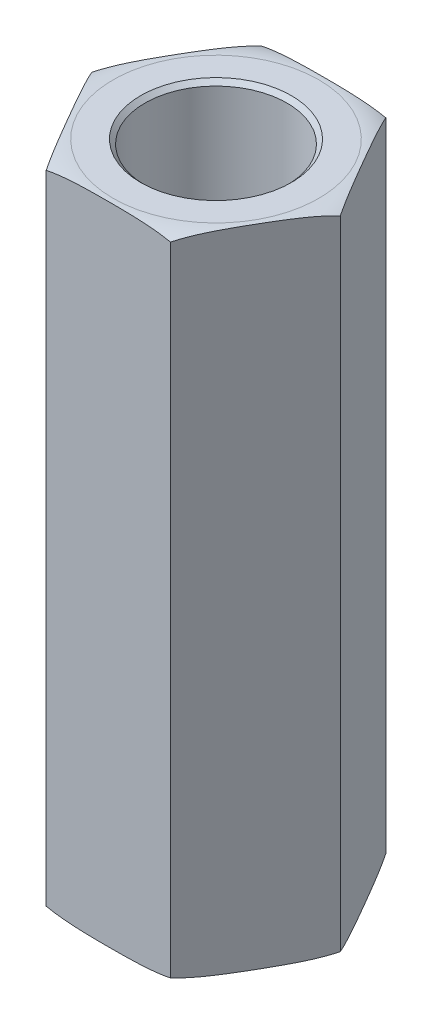
ISO-10303-21;
HEADER;
FILE_DESCRIPTION(('STEP AP214'),'2;1');
FILE_NAME('part.step','',(''),(''),'','','');
FILE_SCHEMA(('AUTOMOTIVE_DESIGN { 1 0 10303 214 1 1 1 1 }'));
ENDSEC;
DATA;
#1=APPLICATION_CONTEXT('core data for automotive mechanical design processes');
#2=APPLICATION_PROTOCOL_DEFINITION('international standard','automotive_design',2000,#1);
#3=PRODUCT_CONTEXT('',#1,'mechanical');
#4=PRODUCT('Part','Part','',(#3));
#5=PRODUCT_RELATED_PRODUCT_CATEGORY('part','',(#4));
#6=PRODUCT_DEFINITION_FORMATION('','',#4);
#7=PRODUCT_DEFINITION_CONTEXT('part definition',#1,'design');
#8=PRODUCT_DEFINITION('design','',#6,#7);
#9=PRODUCT_DEFINITION_SHAPE('','',#8);
#10=(LENGTH_UNIT() NAMED_UNIT(*) SI_UNIT(.MILLI.,.METRE.));
#11=(NAMED_UNIT(*) PLANE_ANGLE_UNIT() SI_UNIT($,.RADIAN.));
#12=(NAMED_UNIT(*) SI_UNIT($,.STERADIAN.) SOLID_ANGLE_UNIT());
#13=UNCERTAINTY_MEASURE_WITH_UNIT(LENGTH_MEASURE(1.E-05),#10,'distance_accuracy_value','');
#14=(GEOMETRIC_REPRESENTATION_CONTEXT(3) GLOBAL_UNCERTAINTY_ASSIGNED_CONTEXT((#13)) GLOBAL_UNIT_ASSIGNED_CONTEXT((#10,
#11,#12)) REPRESENTATION_CONTEXT('',''));
#15=CARTESIAN_POINT('',(0.,0.,0.));
#16=DIRECTION('',(0.,0.,1.));
#17=DIRECTION('',(1.,0.,0.));
#18=AXIS2_PLACEMENT_3D('',#15,#16,#17);
#19=CARTESIAN_POINT('',(3.66617420935412,9.525,0.));
#20=DIRECTION('',(-0.866025403784439,0.,0.5));
#21=DIRECTION('',(0.5,0.,0.866025403784439));
#22=AXIS2_PLACEMENT_3D('',#19,#20,#21);
#23=PLANE('',#22);
#24=DIRECTION('',(0.,1.,0.));
#25=VECTOR('',#24,1.);
#26=CARTESIAN_POINT('',(1.83308710467705,9.525,-3.175));
#27=LINE('',#26,#25);
#28=CARTESIAN_POINT('',(1.83308710467705,-9.398,-3.175));
#29=VERTEX_POINT('',#28);
#30=CARTESIAN_POINT('',(1.83308710467706,9.398,-3.175));
#31=VERTEX_POINT('',#30);
#32=EDGE_CURVE('E143',#29,#31,#27,.T.);
#33=ORIENTED_EDGE('',*,*,#32,.T.);
#34=CARTESIAN_POINT('',(3.66617420935412,9.398,0.));
#35=CARTESIAN_POINT('',(3.62797961467395,9.41390141489969,-0.0661549785605542));
#36=CARTESIAN_POINT('',(3.58956810864157,9.4274886076105,-0.132685658603869));
#37=CARTESIAN_POINT('',(3.51249051795711,9.45081619794021,-0.266187961794349));
#38=CARTESIAN_POINT('',(3.47382473049847,9.46056047713974,-0.333159070187379));
#39=CARTESIAN_POINT('',(3.39641631867874,9.4769966530451,-0.467234372392366));
#40=CARTESIAN_POINT('',(3.35767399633313,9.48369453286691,-0.534338043098168));
#41=CARTESIAN_POINT('',(3.28009834620114,9.4947767572932,-0.668703010556962));
#42=CARTESIAN_POINT('',(3.24126499587772,9.49916045047396,-0.735964346345247));
#43=CARTESIAN_POINT('',(3.16354065964316,9.50624030042628,-0.870586845688074));
#44=CARTESIAN_POINT('',(3.12464965374477,9.50893552375912,-0.937948043861543));
#45=CARTESIAN_POINT('',(3.04685144594594,9.51315319837134,-1.07269849250692));
#46=CARTESIAN_POINT('',(3.00794424351971,9.51467560802717,-1.14008774388952));
#47=CARTESIAN_POINT('',(2.93051517598875,9.51692270588903,-1.27419882283583));
#48=CARTESIAN_POINT('',(2.89199336248936,9.51765524681809,-1.34092056101645));
#49=CARTESIAN_POINT('',(2.81494778346146,9.51857673025742,-1.47436741839135));
#50=CARTESIAN_POINT('',(2.77642401791441,9.51876566589491,-1.5410925376177));
#51=CARTESIAN_POINT('',(2.69935964431015,9.51866599668056,-1.67457194815376));
#52=CARTESIAN_POINT('',(2.66081903631824,9.51837718117656,-1.74132623935034));
#53=CARTESIAN_POINT('',(2.58373908085332,9.517221986219,-1.87483263846072));
#54=CARTESIAN_POINT('',(2.54519973341248,9.51635559703857,-1.94158474631881));
#55=CARTESIAN_POINT('',(2.46812969629774,9.51378619406564,-2.07507396634277));
#56=CARTESIAN_POINT('',(2.42959900625968,9.51208322716166,-2.14181107913937));
#57=CARTESIAN_POINT('',(2.35255651340912,9.50743872297261,-2.27525259109831));
#58=CARTESIAN_POINT('',(2.31404470975446,9.50449724713581,-2.34195699171929));
#59=CARTESIAN_POINT('',(2.25084206239948,9.49821741247489,-2.45142718811098));
#60=CARTESIAN_POINT('',(2.22613849337013,9.49539801104633,-2.4942150247981));
#61=CARTESIAN_POINT('',(2.1767694527223,9.48886967943037,-2.57972471152106));
#62=CARTESIAN_POINT('',(2.15210397034186,9.48516108091391,-2.62244658019719));
#63=CARTESIAN_POINT('',(2.10282753811698,9.4766802711497,-2.70779586442641));
#64=CARTESIAN_POINT('',(2.07821657107531,9.47190846570085,-2.75042330976598));
#65=CARTESIAN_POINT('',(2.02900094683551,9.4610987712516,-2.83566727147553));
#66=CARTESIAN_POINT('',(2.00439646085464,9.45505773130843,-2.87828349128851));
#67=CARTESIAN_POINT('',(1.95527325900934,9.44151383541612,-2.96336737271503));
#68=CARTESIAN_POINT('',(1.93075459617615,9.43401019780297,-3.00583494247578));
#69=CARTESIAN_POINT('',(1.88182157373171,9.41732035070844,-3.09058942351744));
#70=CARTESIAN_POINT('',(1.85740744053269,9.40813149780328,-3.1328759426409));
#71=CARTESIAN_POINT('',(1.83308710467706,9.398,-3.175));
#72=B_SPLINE_CURVE_WITH_KNOTS('',3,(#34,#35,#36,#37,#38,#39,#40,#41,#42,#43,#44,#45,#46,#47,#48,
#49,#50,#51,#52,#53,#54,#55,#56,#57,#58,#59,#60,#61,#62,#63,#64,#65,#66,#67,#68,#69,#70,#71),
.UNSPECIFIED.,.F.,.F.,(4,2,2,2,2,2,2,2,2,2,2,2,2,2,2,2,2,2,4),(0.,0.233977307817935,
0.467717675040681,0.70099697355748,0.934341903229723,1.16781571967236,1.40129782179821,
1.63243665809665,1.86357841666612,2.09482211846288,2.32606971471488,2.5573043514739,
2.78852751694405,2.93698369265081,3.08538458004469,3.23372892334581,3.3824459854661,
3.53124274626083,3.68027493713586),.UNSPECIFIED.);
#73=CARTESIAN_POINT('',(3.66617420935412,9.398,0.));
#74=VERTEX_POINT('',#73);
#75=EDGE_CURVE('E97',#74,#31,#72,.T.);
#76=ORIENTED_EDGE('',*,*,#75,.F.);
#77=DIRECTION('',(0.,1.,0.));
#78=VECTOR('',#77,1.);
#79=CARTESIAN_POINT('',(3.66617420935412,9.525,0.));
#80=LINE('',#79,#78);
#81=CARTESIAN_POINT('',(3.66617420935412,-9.398,0.));
#82=VERTEX_POINT('',#81);
#83=EDGE_CURVE('E145',#74,#82,#80,.F.);
#84=ORIENTED_EDGE('',*,*,#83,.T.);
#85=CARTESIAN_POINT('',(1.83308710467705,-9.398,-3.17500000000001));
#86=CARTESIAN_POINT('',(1.87128169935722,-9.41390141489968,-3.10884502143945));
#87=CARTESIAN_POINT('',(1.9096932053896,-9.4274886076105,-3.04231434139614));
#88=CARTESIAN_POINT('',(1.98677079607406,-9.4508161979402,-2.90881203820566));
#89=CARTESIAN_POINT('',(2.0254365835327,-9.46056047713973,-2.84184092981263));
#90=CARTESIAN_POINT('',(2.10284499535243,-9.47699665304509,-2.70776562760765));
#91=CARTESIAN_POINT('',(2.14158731769803,-9.48369453286691,-2.64066195690184));
#92=CARTESIAN_POINT('',(2.21916296783002,-9.49477675729319,-2.50629698944305));
#93=CARTESIAN_POINT('',(2.25799631815344,-9.49916045047396,-2.43903565365477));
#94=CARTESIAN_POINT('',(2.335720654388,-9.50624030042628,-2.30441315431194));
#95=CARTESIAN_POINT('',(2.37461166028639,-9.50893552375912,-2.23705195613848));
#96=CARTESIAN_POINT('',(2.45240986808522,-9.51315319837134,-2.10230150749311));
#97=CARTESIAN_POINT('',(2.49131707051145,-9.51467560802717,-2.0349122561105));
#98=CARTESIAN_POINT('',(2.56874613804241,-9.51692270588903,-1.9008011771642));
#99=CARTESIAN_POINT('',(2.6072679515418,-9.51765524681809,-1.83407943898357));
#100=CARTESIAN_POINT('',(2.6843135305697,-9.51857673025742,-1.70063258160867));
#101=CARTESIAN_POINT('',(2.72283729611674,-9.51876566589491,-1.63390746238233));
#102=CARTESIAN_POINT('',(2.79990166972101,-9.51866599668056,-1.50042805184627));
#103=CARTESIAN_POINT('',(2.83844227771292,-9.51837718117656,-1.43367376064969));
#104=CARTESIAN_POINT('',(2.91552223317783,-9.517221986219,-1.30016736153931));
#105=CARTESIAN_POINT('',(2.95406158061867,-9.51635559703857,-1.23341525368122));
#106=CARTESIAN_POINT('',(3.03113161773342,-9.51378619406564,-1.09992603365727));
#107=CARTESIAN_POINT('',(3.06966230777147,-9.51208322716166,-1.03318892086067));
#108=CARTESIAN_POINT('',(3.14670480062203,-9.50743872297261,-0.899747408901733));
#109=CARTESIAN_POINT('',(3.18521660427669,-9.50449724713582,-0.83304300828075));
#110=CARTESIAN_POINT('',(3.24841925163167,-9.49821741247489,-0.723572811889063));
#111=CARTESIAN_POINT('',(3.27312282066102,-9.49539801104633,-0.680784975201942));
#112=CARTESIAN_POINT('',(3.32249186130885,-9.48886967943037,-0.595275288478971));
#113=CARTESIAN_POINT('',(3.3471573436893,-9.48516108091391,-0.552553419802841));
#114=CARTESIAN_POINT('',(3.39643377591418,-9.4766802711497,-0.46720413557362));
#115=CARTESIAN_POINT('',(3.42104474295585,-9.47190846570085,-0.424576690234039));
#116=CARTESIAN_POINT('',(3.47026036719565,-9.4610987712516,-0.339332728524487));
#117=CARTESIAN_POINT('',(3.49486485317652,-9.45505773130843,-0.296716508711511));
#118=CARTESIAN_POINT('',(3.54398805502183,-9.44151383541613,-0.211632627284978));
#119=CARTESIAN_POINT('',(3.56850671785502,-9.43401019780297,-0.169165057524231));
#120=CARTESIAN_POINT('',(3.61743974029946,-9.41732035070845,-0.08441057648256));
#121=CARTESIAN_POINT('',(3.64185387349848,-9.40813149780329,-0.0421240573591054));
#122=CARTESIAN_POINT('',(3.66617420935412,-9.398,0.));
#123=B_SPLINE_CURVE_WITH_KNOTS('',3,(#85,#86,#87,#88,#89,#90,#91,#92,#93,#94,#95,#96,#97,#98,
#99,#100,#101,#102,#103,#104,#105,#106,#107,#108,#109,#110,#111,#112,#113,#114,#115,#116,#117,
#118,#119,#120,#121,#122),.UNSPECIFIED.,.F.,.F.,(4,2,2,2,2,2,2,2,2,2,2,2,2,2,2,2,2,2,4),(0.,
0.233977307817932,0.467717675040674,0.700996973557469,0.934341903229708,1.16781571967234,
1.40129782179818,1.63243665809662,1.86357841666608,2.09482211846285,2.32606971471484,
2.55730435147386,2.78852751694401,2.93698369265077,3.08538458004466,3.23372892334579,
3.38244598546609,3.53124274626083,3.68027493713586),.UNSPECIFIED.);
#124=EDGE_CURVE('E221',#29,#82,#123,.T.);
#125=ORIENTED_EDGE('',*,*,#124,.F.);
#126=EDGE_LOOP('',(#33,#76,#84,#125));
#127=FACE_BOUND('',#126,.T.);
#128=ADVANCED_FACE('F17',(#127),#23,.F.);
#129=CARTESIAN_POINT('',(1.83308710467706,9.525,3.17499999999999));
#130=DIRECTION('',(-0.866025403784439,0.,-0.5));
#131=DIRECTION('',(-0.5,0.,0.866025403784439));
#132=AXIS2_PLACEMENT_3D('',#129,#130,#131);
#133=PLANE('',#132);
#134=ORIENTED_EDGE('',*,*,#83,.F.);
#135=CARTESIAN_POINT('',(1.83308710467706,9.398,3.17499999999999));
#136=CARTESIAN_POINT('',(1.87128169935724,9.41390141489969,3.10884502143943));
#137=CARTESIAN_POINT('',(1.90969320538961,9.4274886076105,3.04231434139612));
#138=CARTESIAN_POINT('',(1.98677079607407,9.45081619794021,2.90881203820564));
#139=CARTESIAN_POINT('',(2.02543658353271,9.46056047713974,2.84184092981261));
#140=CARTESIAN_POINT('',(2.10284499535245,9.4769966530451,2.70776562760762));
#141=CARTESIAN_POINT('',(2.14158731769805,9.48369453286691,2.64066195690182));
#142=CARTESIAN_POINT('',(2.21916296783004,9.4947767572932,2.50629698944302));
#143=CARTESIAN_POINT('',(2.25799631815346,9.49916045047396,2.43903565365474));
#144=CARTESIAN_POINT('',(2.33572065438802,9.50624030042628,2.30441315431191));
#145=CARTESIAN_POINT('',(2.37461166028641,9.50893552375912,2.23705195613844));
#146=CARTESIAN_POINT('',(2.45240986808524,9.51315319837134,2.10230150749307));
#147=CARTESIAN_POINT('',(2.49131707051148,9.51467560802717,2.03491225611046));
#148=CARTESIAN_POINT('',(2.56874613804244,9.51692270588903,1.90080117716416));
#149=CARTESIAN_POINT('',(2.60726795154182,9.51765524681809,1.83407943898353));
#150=CARTESIAN_POINT('',(2.68431353056973,9.51857673025742,1.70063258160863));
#151=CARTESIAN_POINT('',(2.72283729611677,9.51876566589491,1.63390746238228));
#152=CARTESIAN_POINT('',(2.79990166972104,9.51866599668056,1.50042805184622));
#153=CARTESIAN_POINT('',(2.83844227771295,9.51837718117656,1.43367376064964));
#154=CARTESIAN_POINT('',(2.91552223317786,9.517221986219,1.30016736153926));
#155=CARTESIAN_POINT('',(2.95406158061871,9.51635559703857,1.23341525368117));
#156=CARTESIAN_POINT('',(3.03113161773345,9.51378619406564,1.09992603365721));
#157=CARTESIAN_POINT('',(3.06966230777151,9.51208322716166,1.03318892086061));
#158=CARTESIAN_POINT('',(3.14670480062207,9.50743872297261,0.899747408901672));
#159=CARTESIAN_POINT('',(3.18521660427673,9.50449724713581,0.833043008280688));
#160=CARTESIAN_POINT('',(3.24841925163171,9.49821741247489,0.723572811889004));
#161=CARTESIAN_POINT('',(3.27312282066106,9.49539801104633,0.680784975201887));
#162=CARTESIAN_POINT('',(3.32249186130888,9.48886967943037,0.595275288478923));
#163=CARTESIAN_POINT('',(3.34715734368933,9.48516108091391,0.552553419802797));
#164=CARTESIAN_POINT('',(3.3964337759142,9.4766802711497,0.467204135573584));
#165=CARTESIAN_POINT('',(3.42104474295588,9.47190846570085,0.424576690234007));
#166=CARTESIAN_POINT('',(3.47026036719567,9.4610987712516,0.339332728524462));
#167=CARTESIAN_POINT('',(3.49486485317654,9.45505773130843,0.296716508711489));
#168=CARTESIAN_POINT('',(3.54398805502184,9.44151383541612,0.211632627284964));
#169=CARTESIAN_POINT('',(3.56850671785503,9.43401019780297,0.169165057524221));
#170=CARTESIAN_POINT('',(3.61743974029946,9.41732035070844,0.0844105764825579));
#171=CARTESIAN_POINT('',(3.64185387349848,9.40813149780328,0.042124057359107));
#172=CARTESIAN_POINT('',(3.66617420935412,9.398,0.));
#173=B_SPLINE_CURVE_WITH_KNOTS('',3,(#135,#136,#137,#138,#139,#140,#141,#142,#143,#144,#145,
#146,#147,#148,#149,#150,#151,#152,#153,#154,#155,#156,#157,#158,#159,#160,#161,#162,#163,#164,
#165,#166,#167,#168,#169,#170,#171,#172),.UNSPECIFIED.,.F.,.F.,(4,2,2,2,2,2,2,2,2,2,2,2,2,2,2,2,
2,2,4),(0.,0.233977307817936,0.467717675040682,0.700996973557482,0.934341903229727,
1.16781571967237,1.40129782179821,1.63243665809666,1.86357841666612,2.09482211846289,
2.32606971471489,2.55730435147391,2.78852751694406,2.93698369265081,3.08538458004469,
3.23372892334581,3.3824459854661,3.53124274626082,3.68027493713584),.UNSPECIFIED.);
#174=CARTESIAN_POINT('',(1.83308710467707,9.398,3.17499999999999));
#175=VERTEX_POINT('',#174);
#176=EDGE_CURVE('E214',#175,#74,#173,.T.);
#177=ORIENTED_EDGE('',*,*,#176,.F.);
#178=DIRECTION('',(0.,1.,0.));
#179=VECTOR('',#178,1.);
#180=CARTESIAN_POINT('',(1.83308710467707,9.525,3.17499999999999));
#181=LINE('',#180,#179);
#182=CARTESIAN_POINT('',(1.83308710467706,-9.398,3.17499999999999));
#183=VERTEX_POINT('',#182);
#184=EDGE_CURVE('E140',#175,#183,#181,.F.);
#185=ORIENTED_EDGE('',*,*,#184,.T.);
#186=CARTESIAN_POINT('',(3.66617420935412,-9.398,0.));
#187=CARTESIAN_POINT('',(3.62797961467395,-9.41390141489969,0.0661549785605599));
#188=CARTESIAN_POINT('',(3.58956810864157,-9.4274886076105,0.132685658603875));
#189=CARTESIAN_POINT('',(3.51249051795711,-9.45081619794021,0.266187961794355));
#190=CARTESIAN_POINT('',(3.47382473049847,-9.46056047713974,0.333159070187385));
#191=CARTESIAN_POINT('',(3.39641631867874,-9.4769966530451,0.467234372392373));
#192=CARTESIAN_POINT('',(3.35767399633313,-9.48369453286691,0.534338043098174));
#193=CARTESIAN_POINT('',(3.28009834620114,-9.4947767572932,0.668703010556968));
#194=CARTESIAN_POINT('',(3.24126499587772,-9.49916045047396,0.735964346345254));
#195=CARTESIAN_POINT('',(3.16354065964316,-9.50624030042628,0.87058684568808));
#196=CARTESIAN_POINT('',(3.12464965374477,-9.50893552375912,0.93794804386155));
#197=CARTESIAN_POINT('',(3.04685144594594,-9.51315319837134,1.07269849250692));
#198=CARTESIAN_POINT('',(3.00794424351971,-9.51467560802717,1.14008774388953));
#199=CARTESIAN_POINT('',(2.93051517598875,-9.51692270588903,1.27419882283583));
#200=CARTESIAN_POINT('',(2.89199336248936,-9.51765524681809,1.34092056101646));
#201=CARTESIAN_POINT('',(2.81494778346145,-9.51857673025742,1.47436741839136));
#202=CARTESIAN_POINT('',(2.77642401791441,-9.51876566589491,1.54109253761771));
#203=CARTESIAN_POINT('',(2.69935964431015,-9.51866599668056,1.67457194815377));
#204=CARTESIAN_POINT('',(2.66081903631824,-9.51837718117656,1.74132623935035));
#205=CARTESIAN_POINT('',(2.58373908085332,-9.517221986219,1.87483263846073));
#206=CARTESIAN_POINT('',(2.54519973341248,-9.51635559703857,1.94158474631882));
#207=CARTESIAN_POINT('',(2.46812969629773,-9.51378619406564,2.07507396634278));
#208=CARTESIAN_POINT('',(2.42959900625968,-9.51208322716166,2.14181107913938));
#209=CARTESIAN_POINT('',(2.35255651340911,-9.50743872297261,2.27525259109832));
#210=CARTESIAN_POINT('',(2.31404470975446,-9.50449724713581,2.3419569917193));
#211=CARTESIAN_POINT('',(2.25084206239948,-9.49821741247489,2.45142718811099));
#212=CARTESIAN_POINT('',(2.22613849337013,-9.49539801104633,2.4942150247981));
#213=CARTESIAN_POINT('',(2.1767694527223,-9.48886967943037,2.57972471152107));
#214=CARTESIAN_POINT('',(2.15210397034186,-9.48516108091391,2.62244658019719));
#215=CARTESIAN_POINT('',(2.10282753811698,-9.4766802711497,2.70779586442641));
#216=CARTESIAN_POINT('',(2.07821657107531,-9.47190846570085,2.75042330976598));
#217=CARTESIAN_POINT('',(2.02900094683551,-9.4610987712516,2.83566727147553));
#218=CARTESIAN_POINT('',(2.00439646085465,-9.45505773130843,2.8782834912885));
#219=CARTESIAN_POINT('',(1.95527325900934,-9.44151383541612,2.96336737271503));
#220=CARTESIAN_POINT('',(1.93075459617615,-9.43401019780296,3.00583494247577));
#221=CARTESIAN_POINT('',(1.88182157373172,-9.41732035070844,3.09058942351744));
#222=CARTESIAN_POINT('',(1.8574074405327,-9.40813149780329,3.13287594264089));
#223=CARTESIAN_POINT('',(1.83308710467706,-9.398,3.17499999999999));
#224=B_SPLINE_CURVE_WITH_KNOTS('',3,(#186,#187,#188,#189,#190,#191,#192,#193,#194,#195,#196,
#197,#198,#199,#200,#201,#202,#203,#204,#205,#206,#207,#208,#209,#210,#211,#212,#213,#214,#215,
#216,#217,#218,#219,#220,#221,#222,#223),.UNSPECIFIED.,.F.,.F.,(4,2,2,2,2,2,2,2,2,2,2,2,2,2,2,2,
2,2,4),(0.,0.233977307817936,0.467717675040682,0.700996973557481,0.934341903229725,
1.16781571967236,1.40129782179821,1.63243665809665,1.86357841666612,2.09482211846289,
2.32606971471488,2.55730435147391,2.78852751694405,2.93698369265081,3.08538458004468,
3.2337289233458,3.38244598546609,3.53124274626082,3.68027493713584),.UNSPECIFIED.);
#225=EDGE_CURVE('E240',#82,#183,#224,.T.);
#226=ORIENTED_EDGE('',*,*,#225,.F.);
#227=EDGE_LOOP('',(#134,#177,#185,#226));
#228=FACE_BOUND('',#227,.T.);
#229=ADVANCED_FACE('F218',(#228),#133,.F.);
#230=CARTESIAN_POINT('',(1.83308710467706,9.525,-3.175));
#231=DIRECTION('',(0.,0.,1.));
#232=DIRECTION('',(1.,0.,0.));
#233=AXIS2_PLACEMENT_3D('',#230,#231,#232);
#234=PLANE('',#233);
#235=DIRECTION('',(0.,1.,0.));
#236=VECTOR('',#235,1.);
#237=CARTESIAN_POINT('',(-1.83308710467707,9.525,-3.175));
#238=LINE('',#237,#236);
#239=CARTESIAN_POINT('',(-1.83308710467707,-9.39799999999999,-3.175));
#240=VERTEX_POINT('',#239);
#241=CARTESIAN_POINT('',(-1.83308710467706,9.398,-3.17500000000001));
#242=VERTEX_POINT('',#241);
#243=EDGE_CURVE('E104',#240,#242,#238,.T.);
#244=ORIENTED_EDGE('',*,*,#243,.T.);
#245=CARTESIAN_POINT('',(1.83308710467706,9.398,-3.175));
#246=CARTESIAN_POINT('',(1.73237579828683,9.41894001415179,-3.175));
#247=CARTESIAN_POINT('',(1.63096506893486,9.43588534953273,-3.175));
#248=CARTESIAN_POINT('',(1.42767146651469,9.46349716439842,-3.175));
#249=CARTESIAN_POINT('',(1.32579191427254,9.47418756587531,-3.175));
#250=CARTESIAN_POINT('',(1.12177634709137,9.49112804080793,-3.175));
#251=CARTESIAN_POINT('',(1.0196405664338,9.49738127071887,-3.175));
#252=CARTESIAN_POINT('',(0.815663681397375,9.50690280641833,-3.175));
#253=CARTESIAN_POINT('',(0.713823115514573,9.5101834044999,-3.175));
#254=CARTESIAN_POINT('',(0.510018485441651,9.51494548487028,-3.175));
#255=CARTESIAN_POINT('',(0.408054390577976,9.51642541008817,-3.175));
#256=CARTESIAN_POINT('',(0.20406020033787,9.51831468183793,-3.175));
#257=CARTESIAN_POINT('',(0.102030100168935,9.51872342414921,-3.175));
#258=CARTESIAN_POINT('',(-0.102030100168934,9.51872342414921,-3.175));
#259=CARTESIAN_POINT('',(-0.204060200337869,9.51831468183793,-3.175));
#260=CARTESIAN_POINT('',(-0.408054390577975,9.51642541008817,-3.175));
#261=CARTESIAN_POINT('',(-0.510018485441649,9.51494548487028,-3.175));
#262=CARTESIAN_POINT('',(-0.713823115514571,9.5101834044999,-3.175));
#263=CARTESIAN_POINT('',(-0.815663681397373,9.50690280641833,-3.175));
#264=CARTESIAN_POINT('',(-1.01964056643379,9.49738127071887,-3.175));
#265=CARTESIAN_POINT('',(-1.12177634709137,9.49112804080793,-3.175));
#266=CARTESIAN_POINT('',(-1.32579191427253,9.47418756587531,-3.175));
#267=CARTESIAN_POINT('',(-1.42767146651469,9.46349716439842,-3.175));
#268=CARTESIAN_POINT('',(-1.63096506893485,9.43588534953273,-3.175));
#269=CARTESIAN_POINT('',(-1.73237579828683,9.41894001415179,-3.175));
#270=CARTESIAN_POINT('',(-1.83308710467705,9.398,-3.17500000000001));
#271=B_SPLINE_CURVE_WITH_KNOTS('',3,(#245,#246,#247,#248,#249,#250,#251,#252,#253,#254,#255,
#256,#257,#258,#259,#260,#261,#262,#263,#264,#265,#266,#267,#268,#269,#270),.UNSPECIFIED.,.F.,
.F.,(4,2,2,2,2,2,2,2,2,2,2,2,4),(0.,0.308333242342807,0.615479423308234,0.922406891130008,
1.2280592962085,1.53397581645216,1.84006485747889,2.14615389850561,2.45207041874927,
2.75772282382776,3.06465029164954,3.37179647261496,3.68012971495777),.UNSPECIFIED.);
#272=EDGE_CURVE('E89',#31,#242,#271,.T.);
#273=ORIENTED_EDGE('',*,*,#272,.F.);
#274=ORIENTED_EDGE('',*,*,#32,.F.);
#275=CARTESIAN_POINT('',(-1.83308710467707,-9.39799999999999,-3.175));
#276=CARTESIAN_POINT('',(-1.73237579828684,-9.41894001415179,-3.175));
#277=CARTESIAN_POINT('',(-1.63096506893487,-9.43588534953273,-3.175));
#278=CARTESIAN_POINT('',(-1.4276714665147,-9.46349716439842,-3.175));
#279=CARTESIAN_POINT('',(-1.32579191427255,-9.47418756587531,-3.175));
#280=CARTESIAN_POINT('',(-1.12177634709138,-9.49112804080793,-3.175));
#281=CARTESIAN_POINT('',(-1.0196405664338,-9.49738127071887,-3.175));
#282=CARTESIAN_POINT('',(-0.81566368139738,-9.50690280641833,-3.175));
#283=CARTESIAN_POINT('',(-0.713823115514577,-9.5101834044999,-3.175));
#284=CARTESIAN_POINT('',(-0.510018485441654,-9.51494548487028,-3.175));
#285=CARTESIAN_POINT('',(-0.408054390577979,-9.51642541008817,-3.175));
#286=CARTESIAN_POINT('',(-0.204060200337872,-9.51831468183793,-3.175));
#287=CARTESIAN_POINT('',(-0.102030100168936,-9.51872342414921,-3.175));
#288=CARTESIAN_POINT('',(0.102030100168934,-9.51872342414921,-3.175));
#289=CARTESIAN_POINT('',(0.204060200337869,-9.51831468183793,-3.175));
#290=CARTESIAN_POINT('',(0.408054390577974,-9.51642541008817,-3.175));
#291=CARTESIAN_POINT('',(0.510018485441648,-9.51494548487028,-3.175));
#292=CARTESIAN_POINT('',(0.713823115514568,-9.5101834044999,-3.175));
#293=CARTESIAN_POINT('',(0.81566368139737,-9.50690280641833,-3.175));
#294=CARTESIAN_POINT('',(1.01964056643379,-9.49738127071887,-3.175));
#295=CARTESIAN_POINT('',(1.12177634709137,-9.49112804080794,-3.175));
#296=CARTESIAN_POINT('',(1.32579191427253,-9.47418756587531,-3.175));
#297=CARTESIAN_POINT('',(1.42767146651468,-9.46349716439843,-3.175));
#298=CARTESIAN_POINT('',(1.63096506893485,-9.43588534953273,-3.175));
#299=CARTESIAN_POINT('',(1.73237579828682,-9.41894001415179,-3.175));
#300=CARTESIAN_POINT('',(1.83308710467705,-9.398,-3.175));
#301=B_SPLINE_CURVE_WITH_KNOTS('',3,(#275,#276,#277,#278,#279,#280,#281,#282,#283,#284,#285,
#286,#287,#288,#289,#290,#291,#292,#293,#294,#295,#296,#297,#298,#299,#300),.UNSPECIFIED.,.F.,
.F.,(4,2,2,2,2,2,2,2,2,2,2,2,4),(0.,0.308333242342809,0.615479423308238,0.922406891130013,
1.22805929620851,1.53397581645217,1.8400648574789,2.14615389850562,2.45207041874928,
2.75772282382777,3.06465029164954,3.37179647261497,3.68012971495777),.UNSPECIFIED.);
#302=EDGE_CURVE('E106',#240,#29,#301,.T.);
#303=ORIENTED_EDGE('',*,*,#302,.F.);
#304=EDGE_LOOP('',(#244,#273,#274,#303));
#305=FACE_BOUND('',#304,.T.);
#306=ADVANCED_FACE('F105',(#305),#234,.F.);
#307=CARTESIAN_POINT('',(-1.83308710467707,9.525,3.175));
#308=DIRECTION('',(0.,0.,-1.));
#309=DIRECTION('',(-1.,0.,0.));
#310=AXIS2_PLACEMENT_3D('',#307,#308,#309);
#311=PLANE('',#310);
#312=ORIENTED_EDGE('',*,*,#184,.F.);
#313=CARTESIAN_POINT('',(-1.83308710467706,9.398,3.175));
#314=CARTESIAN_POINT('',(-1.73237579828684,9.41894001415179,3.175));
#315=CARTESIAN_POINT('',(-1.63096506893486,9.43588534953273,3.175));
#316=CARTESIAN_POINT('',(-1.42767146651469,9.46349716439843,3.175));
#317=CARTESIAN_POINT('',(-1.32579191427254,9.47418756587531,3.175));
#318=CARTESIAN_POINT('',(-1.12177634709138,9.49112804080793,3.175));
#319=CARTESIAN_POINT('',(-1.0196405664338,9.49738127071888,3.175));
#320=CARTESIAN_POINT('',(-0.815663681397378,9.50690280641833,3.175));
#321=CARTESIAN_POINT('',(-0.713823115514575,9.5101834044999,3.175));
#322=CARTESIAN_POINT('',(-0.510018485441652,9.51494548487029,3.175));
#323=CARTESIAN_POINT('',(-0.408054390577978,9.51642541008817,3.175));
#324=CARTESIAN_POINT('',(-0.204060200337871,9.51831468183793,3.175));
#325=CARTESIAN_POINT('',(-0.102030100168935,9.51872342414921,3.17499999999999));
#326=CARTESIAN_POINT('',(0.102030100168936,9.51872342414921,3.17499999999999));
#327=CARTESIAN_POINT('',(0.204060200337871,9.51831468183793,3.17499999999999));
#328=CARTESIAN_POINT('',(0.408054390577978,9.51642541008817,3.17499999999999));
#329=CARTESIAN_POINT('',(0.510018485441653,9.51494548487029,3.17499999999999));
#330=CARTESIAN_POINT('',(0.713823115514576,9.5101834044999,3.17499999999999));
#331=CARTESIAN_POINT('',(0.815663681397379,9.50690280641833,3.17499999999999));
#332=CARTESIAN_POINT('',(1.0196405664338,9.49738127071888,3.17499999999999));
#333=CARTESIAN_POINT('',(1.12177634709138,9.49112804080794,3.17499999999999));
#334=CARTESIAN_POINT('',(1.32579191427254,9.47418756587531,3.17499999999999));
#335=CARTESIAN_POINT('',(1.4276714665147,9.46349716439843,3.17499999999999));
#336=CARTESIAN_POINT('',(1.63096506893486,9.43588534953273,3.17499999999999));
#337=CARTESIAN_POINT('',(1.73237579828684,9.41894001415179,3.17499999999999));
#338=CARTESIAN_POINT('',(1.83308710467707,9.398,3.17499999999999));
#339=B_SPLINE_CURVE_WITH_KNOTS('',3,(#313,#314,#315,#316,#317,#318,#319,#320,#321,#322,#323,
#324,#325,#326,#327,#328,#329,#330,#331,#332,#333,#334,#335,#336,#337,#338),.UNSPECIFIED.,.F.,
.F.,(4,2,2,2,2,2,2,2,2,2,2,2,4),(0.,0.308333242342809,0.615479423308237,0.922406891130012,
1.2280592962085,1.53397581645216,1.84006485747889,2.14615389850562,2.45207041874928,
2.75772282382778,3.06465029164955,3.37179647261498,3.68012971495779),.UNSPECIFIED.);
#340=CARTESIAN_POINT('',(-1.83308710467707,9.398,3.175));
#341=VERTEX_POINT('',#340);
#342=EDGE_CURVE('E100',#341,#175,#339,.T.);
#343=ORIENTED_EDGE('',*,*,#342,.F.);
#344=DIRECTION('',(0.,1.,0.));
#345=VECTOR('',#344,1.);
#346=CARTESIAN_POINT('',(-1.83308710467707,9.525,3.175));
#347=LINE('',#346,#345);
#348=CARTESIAN_POINT('',(-1.83308710467706,-9.398,3.175));
#349=VERTEX_POINT('',#348);
#350=EDGE_CURVE('E108',#341,#349,#347,.F.);
#351=ORIENTED_EDGE('',*,*,#350,.T.);
#352=CARTESIAN_POINT('',(1.83308710467706,-9.398,3.17499999999999));
#353=CARTESIAN_POINT('',(1.73237579828684,-9.41894001415179,3.17499999999999));
#354=CARTESIAN_POINT('',(1.63096506893486,-9.43588534953273,3.17499999999999));
#355=CARTESIAN_POINT('',(1.4276714665147,-9.46349716439843,3.17499999999999));
#356=CARTESIAN_POINT('',(1.32579191427254,-9.47418756587531,3.17499999999999));
#357=CARTESIAN_POINT('',(1.12177634709138,-9.49112804080793,3.17499999999999));
#358=CARTESIAN_POINT('',(1.0196405664338,-9.49738127071888,3.17499999999999));
#359=CARTESIAN_POINT('',(0.815663681397379,-9.50690280641833,3.17499999999999));
#360=CARTESIAN_POINT('',(0.713823115514576,-9.5101834044999,3.17499999999999));
#361=CARTESIAN_POINT('',(0.510018485441653,-9.51494548487029,3.17499999999999));
#362=CARTESIAN_POINT('',(0.408054390577978,-9.51642541008817,3.17499999999999));
#363=CARTESIAN_POINT('',(0.204060200337871,-9.51831468183793,3.17499999999999));
#364=CARTESIAN_POINT('',(0.102030100168935,-9.51872342414921,3.17499999999999));
#365=CARTESIAN_POINT('',(-0.102030100168935,-9.51872342414921,3.17499999999999));
#366=CARTESIAN_POINT('',(-0.204060200337871,-9.51831468183793,3.175));
#367=CARTESIAN_POINT('',(-0.408054390577977,-9.51642541008817,3.175));
#368=CARTESIAN_POINT('',(-0.510018485441652,-9.51494548487029,3.175));
#369=CARTESIAN_POINT('',(-0.713823115514575,-9.5101834044999,3.175));
#370=CARTESIAN_POINT('',(-0.815663681397378,-9.50690280641833,3.175));
#371=CARTESIAN_POINT('',(-1.0196405664338,-9.49738127071888,3.175));
#372=CARTESIAN_POINT('',(-1.12177634709138,-9.49112804080793,3.175));
#373=CARTESIAN_POINT('',(-1.32579191427254,-9.47418756587531,3.175));
#374=CARTESIAN_POINT('',(-1.42767146651469,-9.46349716439843,3.175));
#375=CARTESIAN_POINT('',(-1.63096506893486,-9.43588534953273,3.175));
#376=CARTESIAN_POINT('',(-1.73237579828684,-9.41894001415179,3.175));
#377=CARTESIAN_POINT('',(-1.83308710467706,-9.398,3.175));
#378=B_SPLINE_CURVE_WITH_KNOTS('',3,(#352,#353,#354,#355,#356,#357,#358,#359,#360,#361,#362,
#363,#364,#365,#366,#367,#368,#369,#370,#371,#372,#373,#374,#375,#376,#377),.UNSPECIFIED.,.F.,
.F.,(4,2,2,2,2,2,2,2,2,2,2,2,4),(0.,0.308333242342809,0.615479423308237,0.922406891130013,
1.22805929620851,1.53397581645217,1.84006485747889,2.14615389850562,2.45207041874928,
2.75772282382778,3.06465029164955,3.37179647261498,3.68012971495779),.UNSPECIFIED.);
#379=EDGE_CURVE('E208',#183,#349,#378,.T.);
#380=ORIENTED_EDGE('',*,*,#379,.F.);
#381=EDGE_LOOP('',(#312,#343,#351,#380));
#382=FACE_BOUND('',#381,.T.);
#383=ADVANCED_FACE('F370',(#382),#311,.F.);
#384=CARTESIAN_POINT('',(-3.66617420935413,9.525,0.));
#385=DIRECTION('',(0.866025403784439,0.,-0.499999999999999));
#386=DIRECTION('',(-0.499999999999999,0.,-0.866025403784439));
#387=AXIS2_PLACEMENT_3D('',#384,#385,#386);
#388=PLANE('',#387);
#389=ORIENTED_EDGE('',*,*,#350,.F.);
#390=CARTESIAN_POINT('',(-3.66617420935412,9.398,0.));
#391=CARTESIAN_POINT('',(-3.62797961467395,9.41390141489969,0.0661549785605627));
#392=CARTESIAN_POINT('',(-3.58956810864157,9.4274886076105,0.132685658603878));
#393=CARTESIAN_POINT('',(-3.51249051795711,9.4508161979402,0.266187961794359));
#394=CARTESIAN_POINT('',(-3.47382473049847,9.46056047713974,0.333159070187389));
#395=CARTESIAN_POINT('',(-3.39641631867874,9.47699665304509,0.467234372392377));
#396=CARTESIAN_POINT('',(-3.35767399633313,9.48369453286691,0.534338043098178));
#397=CARTESIAN_POINT('',(-3.28009834620114,9.49477675729319,0.668703010556972));
#398=CARTESIAN_POINT('',(-3.24126499587772,9.49916045047396,0.735964346345258));
#399=CARTESIAN_POINT('',(-3.16354065964316,9.50624030042628,0.870586845688085));
#400=CARTESIAN_POINT('',(-3.12464965374477,9.50893552375912,0.937948043861555));
#401=CARTESIAN_POINT('',(-3.04685144594594,9.51315319837134,1.07269849250693));
#402=CARTESIAN_POINT('',(-3.00794424351971,9.51467560802717,1.14008774388953));
#403=CARTESIAN_POINT('',(-2.93051517598875,9.51692270588903,1.27419882283584));
#404=CARTESIAN_POINT('',(-2.89199336248936,9.51765524681809,1.34092056101647));
#405=CARTESIAN_POINT('',(-2.81494778346146,9.51857673025742,1.47436741839137));
#406=CARTESIAN_POINT('',(-2.77642401791441,9.5187656658949,1.54109253761772));
#407=CARTESIAN_POINT('',(-2.69935964431015,9.51866599668056,1.67457194815378));
#408=CARTESIAN_POINT('',(-2.66081903631824,9.51837718117656,1.74132623935036));
#409=CARTESIAN_POINT('',(-2.58373908085332,9.517221986219,1.87483263846074));
#410=CARTESIAN_POINT('',(-2.54519973341248,9.51635559703857,1.94158474631883));
#411=CARTESIAN_POINT('',(-2.46812969629774,9.51378619406564,2.07507396634279));
#412=CARTESIAN_POINT('',(-2.42959900625968,9.51208322716166,2.14181107913938));
#413=CARTESIAN_POINT('',(-2.35255651340912,9.50743872297261,2.27525259109832));
#414=CARTESIAN_POINT('',(-2.31404470975446,9.50449724713581,2.34195699171931));
#415=CARTESIAN_POINT('',(-2.25084206239948,9.49821741247489,2.45142718811099));
#416=CARTESIAN_POINT('',(-2.22613849337013,9.49539801104632,2.49421502479811));
#417=CARTESIAN_POINT('',(-2.17676945272231,9.48886967943037,2.57972471152108));
#418=CARTESIAN_POINT('',(-2.15210397034186,9.48516108091391,2.6224465801972));
#419=CARTESIAN_POINT('',(-2.10282753811698,9.47668027114969,2.70779586442642));
#420=CARTESIAN_POINT('',(-2.07821657107531,9.47190846570085,2.75042330976599));
#421=CARTESIAN_POINT('',(-2.02900094683551,9.4610987712516,2.83566727147554));
#422=CARTESIAN_POINT('',(-2.00439646085465,9.45505773130842,2.87828349128851));
#423=CARTESIAN_POINT('',(-1.95527325900935,9.44151383541612,2.96336737271504));
#424=CARTESIAN_POINT('',(-1.93075459617615,9.43401019780296,3.00583494247578));
#425=CARTESIAN_POINT('',(-1.88182157373172,9.41732035070844,3.09058942351745));
#426=CARTESIAN_POINT('',(-1.8574074405327,9.40813149780328,3.1328759426409));
#427=CARTESIAN_POINT('',(-1.83308710467707,9.398,3.175));
#428=B_SPLINE_CURVE_WITH_KNOTS('',3,(#390,#391,#392,#393,#394,#395,#396,#397,#398,#399,#400,
#401,#402,#403,#404,#405,#406,#407,#408,#409,#410,#411,#412,#413,#414,#415,#416,#417,#418,#419,
#420,#421,#422,#423,#424,#425,#426,#427),.UNSPECIFIED.,.F.,.F.,(4,2,2,2,2,2,2,2,2,2,2,2,2,2,2,2,
2,2,4),(0.,0.233977307817936,0.467717675040682,0.700996973557482,0.934341903229725,
1.16781571967237,1.40129782179821,1.63243665809665,1.86357841666612,2.09482211846289,
2.32606971471489,2.55730435147391,2.78852751694406,2.93698369265081,3.08538458004469,
3.23372892334581,3.3824459854661,3.53124274626082,3.68027493713584),.UNSPECIFIED.);
#429=CARTESIAN_POINT('',(-3.66617420935413,9.398,0.));
#430=VERTEX_POINT('',#429);
#431=EDGE_CURVE('E101',#430,#341,#428,.T.);
#432=ORIENTED_EDGE('',*,*,#431,.F.);
#433=DIRECTION('',(0.,1.,0.));
#434=VECTOR('',#433,1.);
#435=CARTESIAN_POINT('',(-3.66617420935413,9.525,0.));
#436=LINE('',#435,#434);
#437=CARTESIAN_POINT('',(-3.66617420935412,-9.398,0.));
#438=VERTEX_POINT('',#437);
#439=EDGE_CURVE('E83',#430,#438,#436,.F.);
#440=ORIENTED_EDGE('',*,*,#439,.T.);
#441=CARTESIAN_POINT('',(-1.83308710467707,-9.398,3.175));
#442=CARTESIAN_POINT('',(-1.87128169935724,-9.41390141489968,3.10884502143945));
#443=CARTESIAN_POINT('',(-1.90969320538961,-9.4274886076105,3.04231434139613));
#444=CARTESIAN_POINT('',(-1.98677079607407,-9.4508161979402,2.90881203820565));
#445=CARTESIAN_POINT('',(-2.02543658353271,-9.46056047713973,2.84184092981263));
#446=CARTESIAN_POINT('',(-2.10284499535244,-9.47699665304509,2.70776562760764));
#447=CARTESIAN_POINT('',(-2.14158731769805,-9.48369453286691,2.64066195690184));
#448=CARTESIAN_POINT('',(-2.21916296783004,-9.49477675729319,2.50629698944305));
#449=CARTESIAN_POINT('',(-2.25799631815346,-9.49916045047396,2.43903565365476));
#450=CARTESIAN_POINT('',(-2.33572065438802,-9.50624030042628,2.30441315431194));
#451=CARTESIAN_POINT('',(-2.3746116602864,-9.50893552375912,2.23705195613847));
#452=CARTESIAN_POINT('',(-2.45240986808523,-9.51315319837134,2.1023015074931));
#453=CARTESIAN_POINT('',(-2.49131707051146,-9.51467560802717,2.0349122561105));
#454=CARTESIAN_POINT('',(-2.56874613804242,-9.51692270588903,1.90080117716419));
#455=CARTESIAN_POINT('',(-2.60726795154181,-9.51765524681809,1.83407943898357));
#456=CARTESIAN_POINT('',(-2.68431353056971,-9.51857673025742,1.70063258160867));
#457=CARTESIAN_POINT('',(-2.72283729611675,-9.51876566589491,1.63390746238232));
#458=CARTESIAN_POINT('',(-2.79990166972102,-9.51866599668056,1.50042805184626));
#459=CARTESIAN_POINT('',(-2.83844227771293,-9.51837718117656,1.43367376064968));
#460=CARTESIAN_POINT('',(-2.91552223317784,-9.517221986219,1.30016736153931));
#461=CARTESIAN_POINT('',(-2.95406158061869,-9.51635559703857,1.23341525368122));
#462=CARTESIAN_POINT('',(-3.03113161773343,-9.51378619406564,1.09992603365726));
#463=CARTESIAN_POINT('',(-3.06966230777148,-9.51208322716166,1.03318892086066));
#464=CARTESIAN_POINT('',(-3.14670480062204,-9.50743872297261,0.899747408901727));
#465=CARTESIAN_POINT('',(-3.1852166042767,-9.50449724713581,0.833043008280744));
#466=CARTESIAN_POINT('',(-3.24841925163168,-9.49821741247489,0.723572811889058));
#467=CARTESIAN_POINT('',(-3.27312282066103,-9.49539801104633,0.680784975201938));
#468=CARTESIAN_POINT('',(-3.32249186130886,-9.48886967943037,0.595275288478968));
#469=CARTESIAN_POINT('',(-3.34715734368931,-9.48516108091391,0.552553419802839));
#470=CARTESIAN_POINT('',(-3.39643377591419,-9.4766802711497,0.46720413557362));
#471=CARTESIAN_POINT('',(-3.42104474295586,-9.47190846570085,0.42457669023404));
#472=CARTESIAN_POINT('',(-3.47026036719566,-9.4610987712516,0.339332728524489));
#473=CARTESIAN_POINT('',(-3.49486485317653,-9.45505773130843,0.296716508711513));
#474=CARTESIAN_POINT('',(-3.54398805502183,-9.44151383541613,0.211632627284982));
#475=CARTESIAN_POINT('',(-3.56850671785503,-9.43401019780297,0.169165057524236));
#476=CARTESIAN_POINT('',(-3.61743974029946,-9.41732035070845,0.0844105764825669));
#477=CARTESIAN_POINT('',(-3.64185387349848,-9.40813149780329,0.042124057359113));
#478=CARTESIAN_POINT('',(-3.66617420935412,-9.398,0.));
#479=B_SPLINE_CURVE_WITH_KNOTS('',3,(#441,#442,#443,#444,#445,#446,#447,#448,#449,#450,#451,
#452,#453,#454,#455,#456,#457,#458,#459,#460,#461,#462,#463,#464,#465,#466,#467,#468,#469,#470,
#471,#472,#473,#474,#475,#476,#477,#478),.UNSPECIFIED.,.F.,.F.,(4,2,2,2,2,2,2,2,2,2,2,2,2,2,2,2,
2,2,4),(0.,0.233977307817931,0.467717675040673,0.700996973557468,0.934341903229707,
1.16781571967234,1.40129782179818,1.63243665809662,1.86357841666608,2.09482211846285,
2.32606971471484,2.55730435147386,2.788527516944,2.93698369265077,3.08538458004465,
3.23372892334578,3.38244598546608,3.53124274626081,3.68027493713584),.UNSPECIFIED.);
#480=EDGE_CURVE('E162',#349,#438,#479,.T.);
#481=ORIENTED_EDGE('',*,*,#480,.F.);
#482=EDGE_LOOP('',(#389,#432,#440,#481));
#483=FACE_BOUND('',#482,.T.);
#484=ADVANCED_FACE('F211',(#483),#388,.F.);
#485=CARTESIAN_POINT('',(-1.83308710467707,9.525,-3.175));
#486=DIRECTION('',(0.866025403784439,0.,0.5));
#487=DIRECTION('',(0.5,0.,-0.866025403784439));
#488=AXIS2_PLACEMENT_3D('',#485,#486,#487);
#489=PLANE('',#488);
#490=ORIENTED_EDGE('',*,*,#439,.F.);
#491=CARTESIAN_POINT('',(-1.83308710467706,9.39799999999999,-3.17500000000001));
#492=CARTESIAN_POINT('',(-1.87128169935723,9.41390141489968,-3.10884502143945));
#493=CARTESIAN_POINT('',(-1.90969320538961,9.42748860761049,-3.04231434139614));
#494=CARTESIAN_POINT('',(-1.98677079607407,9.4508161979402,-2.90881203820567));
#495=CARTESIAN_POINT('',(-2.02543658353271,9.46056047713973,-2.84184092981264));
#496=CARTESIAN_POINT('',(-2.10284499535244,9.47699665304509,-2.70776562760765));
#497=CARTESIAN_POINT('',(-2.14158731769804,9.48369453286691,-2.64066195690185));
#498=CARTESIAN_POINT('',(-2.21916296783003,9.49477675729319,-2.50629698944306));
#499=CARTESIAN_POINT('',(-2.25799631815345,9.49916045047396,-2.43903565365478));
#500=CARTESIAN_POINT('',(-2.33572065438801,9.50624030042628,-2.30441315431196));
#501=CARTESIAN_POINT('',(-2.3746116602864,9.50893552375912,-2.23705195613849));
#502=CARTESIAN_POINT('',(-2.45240986808522,9.51315319837134,-2.10230150749312));
#503=CARTESIAN_POINT('',(-2.49131707051146,9.51467560802717,-2.03491225611052));
#504=CARTESIAN_POINT('',(-2.56874613804241,9.51692270588903,-1.90080117716422));
#505=CARTESIAN_POINT('',(-2.6072679515418,9.51765524681809,-1.83407943898359));
#506=CARTESIAN_POINT('',(-2.6843135305697,9.51857673025742,-1.70063258160869));
#507=CARTESIAN_POINT('',(-2.72283729611674,9.5187656658949,-1.63390746238234));
#508=CARTESIAN_POINT('',(-2.79990166972101,9.51866599668056,-1.50042805184629));
#509=CARTESIAN_POINT('',(-2.83844227771292,9.51837718117656,-1.43367376064971));
#510=CARTESIAN_POINT('',(-2.91552223317783,9.517221986219,-1.30016736153933));
#511=CARTESIAN_POINT('',(-2.95406158061867,9.51635559703857,-1.23341525368124));
#512=CARTESIAN_POINT('',(-3.03113161773341,9.51378619406564,-1.09992603365729));
#513=CARTESIAN_POINT('',(-3.06966230777147,9.51208322716166,-1.03318892086069));
#514=CARTESIAN_POINT('',(-3.14670480062203,9.50743872297261,-0.899747408901758));
#515=CARTESIAN_POINT('',(-3.18521660427669,9.50449724713581,-0.833043008280777));
#516=CARTESIAN_POINT('',(-3.24841925163167,9.49821741247489,-0.723572811889089));
#517=CARTESIAN_POINT('',(-3.27312282066102,9.49539801104633,-0.680784975201966));
#518=CARTESIAN_POINT('',(-3.32249186130885,9.48886967943037,-0.595275288478991));
#519=CARTESIAN_POINT('',(-3.3471573436893,9.48516108091391,-0.552553419802859));
#520=CARTESIAN_POINT('',(-3.39643377591418,9.4766802711497,-0.467204135573636));
#521=CARTESIAN_POINT('',(-3.42104474295586,9.47190846570085,-0.424576690234054));
#522=CARTESIAN_POINT('',(-3.47026036719566,9.4610987712516,-0.339332728524499));
#523=CARTESIAN_POINT('',(-3.49486485317653,9.45505773130843,-0.29671650871152));
#524=CARTESIAN_POINT('',(-3.54398805502183,9.44151383541612,-0.211632627284985));
#525=CARTESIAN_POINT('',(-3.56850671785503,9.43401019780296,-0.169165057524237));
#526=CARTESIAN_POINT('',(-3.61743974029947,9.41732035070844,-0.0844105764825633));
#527=CARTESIAN_POINT('',(-3.64185387349849,9.40813149780328,-0.0421240573591073));
#528=CARTESIAN_POINT('',(-3.66617420935413,9.39799999999999,0.));
#529=B_SPLINE_CURVE_WITH_KNOTS('',3,(#491,#492,#493,#494,#495,#496,#497,#498,#499,#500,#501,
#502,#503,#504,#505,#506,#507,#508,#509,#510,#511,#512,#513,#514,#515,#516,#517,#518,#519,#520,
#521,#522,#523,#524,#525,#526,#527,#528),.UNSPECIFIED.,.F.,.F.,(4,2,2,2,2,2,2,2,2,2,2,2,2,2,2,2,
2,2,4),(0.,0.233977307817929,0.467717675040669,0.700996973557462,0.9343419032297,
1.16781571967233,1.40129782179817,1.63243665809661,1.86357841666607,2.09482211846283,
2.32606971471482,2.55730435147384,2.78852751694398,2.93698369265075,3.08538458004464,
3.23372892334578,3.38244598546609,3.53124274626083,3.68027493713587),.UNSPECIFIED.);
#530=EDGE_CURVE('E94',#242,#430,#529,.T.);
#531=ORIENTED_EDGE('',*,*,#530,.F.);
#532=ORIENTED_EDGE('',*,*,#243,.F.);
#533=CARTESIAN_POINT('',(-3.66617420935413,-9.39799999999999,0.));
#534=CARTESIAN_POINT('',(-3.62797961467396,-9.41390141489968,-0.0661549785605546));
#535=CARTESIAN_POINT('',(-3.58956810864158,-9.42748860761049,-0.132685658603869));
#536=CARTESIAN_POINT('',(-3.51249051795712,-9.4508161979402,-0.266187961794347));
#537=CARTESIAN_POINT('',(-3.47382473049848,-9.46056047713973,-0.333159070187375));
#538=CARTESIAN_POINT('',(-3.39641631867875,-9.47699665304509,-0.467234372392361));
#539=CARTESIAN_POINT('',(-3.35767399633315,-9.48369453286691,-0.534338043098161));
#540=CARTESIAN_POINT('',(-3.28009834620116,-9.49477675729319,-0.668703010556952));
#541=CARTESIAN_POINT('',(-3.24126499587774,-9.49916045047396,-0.735964346345237));
#542=CARTESIAN_POINT('',(-3.16354065964318,-9.50624030042628,-0.870586845688061));
#543=CARTESIAN_POINT('',(-3.12464965374479,-9.50893552375912,-0.937948043861529));
#544=CARTESIAN_POINT('',(-3.04685144594596,-9.51315319837134,-1.0726984925069));
#545=CARTESIAN_POINT('',(-3.00794424351973,-9.51467560802717,-1.1400877438895));
#546=CARTESIAN_POINT('',(-2.93051517598877,-9.51692270588903,-1.27419882283581));
#547=CARTESIAN_POINT('',(-2.89199336248939,-9.51765524681809,-1.34092056101643));
#548=CARTESIAN_POINT('',(-2.81494778346148,-9.51857673025742,-1.47436741839133));
#549=CARTESIAN_POINT('',(-2.77642401791444,-9.5187656658949,-1.54109253761768));
#550=CARTESIAN_POINT('',(-2.69935964431017,-9.51866599668056,-1.67457194815373));
#551=CARTESIAN_POINT('',(-2.66081903631827,-9.51837718117656,-1.74132623935032));
#552=CARTESIAN_POINT('',(-2.58373908085335,-9.517221986219,-1.87483263846069));
#553=CARTESIAN_POINT('',(-2.54519973341251,-9.51635559703857,-1.94158474631878));
#554=CARTESIAN_POINT('',(-2.46812969629777,-9.51378619406564,-2.07507396634274));
#555=CARTESIAN_POINT('',(-2.42959900625971,-9.51208322716166,-2.14181107913933));
#556=CARTESIAN_POINT('',(-2.35255651340915,-9.50743872297261,-2.27525259109827));
#557=CARTESIAN_POINT('',(-2.31404470975449,-9.50449724713581,-2.34195699171925));
#558=CARTESIAN_POINT('',(-2.25084206239951,-9.49821741247489,-2.45142718811094));
#559=CARTESIAN_POINT('',(-2.22613849337016,-9.49539801104633,-2.49421502479806));
#560=CARTESIAN_POINT('',(-2.17676945272233,-9.48886967943037,-2.57972471152103));
#561=CARTESIAN_POINT('',(-2.15210397034188,-9.48516108091391,-2.62244658019716));
#562=CARTESIAN_POINT('',(-2.102827538117,-9.4766802711497,-2.70779586442638));
#563=CARTESIAN_POINT('',(-2.07821657107533,-9.47190846570085,-2.75042330976596));
#564=CARTESIAN_POINT('',(-2.02900094683553,-9.4610987712516,-2.83566727147552));
#565=CARTESIAN_POINT('',(-2.00439646085466,-9.45505773130843,-2.87828349128849));
#566=CARTESIAN_POINT('',(-1.95527325900936,-9.44151383541612,-2.96336737271502));
#567=CARTESIAN_POINT('',(-1.93075459617616,-9.43401019780296,-3.00583494247577));
#568=CARTESIAN_POINT('',(-1.88182157373173,-9.41732035070844,-3.09058942351744));
#569=CARTESIAN_POINT('',(-1.85740744053271,-9.40813149780328,-3.1328759426409));
#570=CARTESIAN_POINT('',(-1.83308710467707,-9.39799999999999,-3.175));
#571=B_SPLINE_CURVE_WITH_KNOTS('',3,(#533,#534,#535,#536,#537,#538,#539,#540,#541,#542,#543,
#544,#545,#546,#547,#548,#549,#550,#551,#552,#553,#554,#555,#556,#557,#558,#559,#560,#561,#562,
#563,#564,#565,#566,#567,#568,#569,#570),.UNSPECIFIED.,.F.,.F.,(4,2,2,2,2,2,2,2,2,2,2,2,2,2,2,2,
2,2,4),(0.,0.233977307817932,0.467717675040674,0.700996973557469,0.934341903229708,
1.16781571967234,1.40129782179818,1.63243665809662,1.86357841666608,2.09482211846285,
2.32606971471484,2.55730435147386,2.788527516944,2.93698369265077,3.08538458004465,
3.23372892334579,3.38244598546609,3.53124274626082,3.68027493713586),.UNSPECIFIED.);
#572=EDGE_CURVE('E155',#438,#240,#571,.T.);
#573=ORIENTED_EDGE('',*,*,#572,.F.);
#574=EDGE_LOOP('',(#490,#531,#532,#573));
#575=FACE_BOUND('',#574,.T.);
#576=ADVANCED_FACE('F110',(#575),#489,.F.);
#577=CARTESIAN_POINT('',(0.,7.87400000000007,0.));
#578=DIRECTION('',(0.,1.,0.));
#579=DIRECTION('',(0.,0.,1.));
#580=AXIS2_PLACEMENT_3D('',#577,#578,#579);
#581=TOROIDAL_SURFACE('',#580,3.03117420935413,1.65099999999993);
#582=CARTESIAN_POINT('',(0.,9.525,0.));
#583=DIRECTION('',(0.,-1.,0.));
#584=DIRECTION('',(0.,0.,1.));
#585=AXIS2_PLACEMENT_3D('',#582,#583,#584);
#586=CIRCLE('',#585,3.03117420935412);
#587=CARTESIAN_POINT('',(0.,9.525,3.03117420935412));
#588=VERTEX_POINT('',#587);
#589=CARTESIAN_POINT('',(0.,9.525,-3.03117420935412));
#590=VERTEX_POINT('',#589);
#591=EDGE_CURVE('E161',#588,#590,#586,.T.);
#592=ORIENTED_EDGE('',*,*,#591,.T.);
#593=CARTESIAN_POINT('',(0.,9.525,0.));
#594=DIRECTION('',(0.,-1.,0.));
#595=DIRECTION('',(0.,0.,-1.));
#596=AXIS2_PLACEMENT_3D('',#593,#594,#595);
#597=CIRCLE('',#596,3.03117420935412);
#598=EDGE_CURVE('E197',#590,#588,#597,.T.);
#599=ORIENTED_EDGE('',*,*,#598,.T.);
#600=EDGE_LOOP('',(#592,#599));
#601=FACE_BOUND('',#600,.T.);
#602=ORIENTED_EDGE('',*,*,#176,.T.);
#603=ORIENTED_EDGE('',*,*,#75,.T.);
#604=ORIENTED_EDGE('',*,*,#272,.T.);
#605=ORIENTED_EDGE('',*,*,#530,.T.);
#606=ORIENTED_EDGE('',*,*,#431,.T.);
#607=ORIENTED_EDGE('',*,*,#342,.T.);
#608=EDGE_LOOP('',(#602,#603,#604,#605,#606,#607));
#609=FACE_BOUND('',#608,.T.);
#610=ADVANCED_FACE('F92',(#601,#609),#581,.T.);
#611=CARTESIAN_POINT('',(0.,-7.87400000000007,0.));
#612=DIRECTION('',(0.,-1.,0.));
#613=DIRECTION('',(0.,0.,1.));
#614=AXIS2_PLACEMENT_3D('',#611,#612,#613);
#615=TOROIDAL_SURFACE('',#614,3.03117420935413,1.65099999999993);
#616=CARTESIAN_POINT('',(0.,-9.525,0.));
#617=DIRECTION('',(0.,1.,0.));
#618=DIRECTION('',(0.,0.,1.));
#619=AXIS2_PLACEMENT_3D('',#616,#617,#618);
#620=CIRCLE('',#619,3.03117420935412);
#621=CARTESIAN_POINT('',(0.,-9.525,-3.03117420935412));
#622=VERTEX_POINT('',#621);
#623=CARTESIAN_POINT('',(0.,-9.525,3.03117420935412));
#624=VERTEX_POINT('',#623);
#625=EDGE_CURVE('E37',#622,#624,#620,.F.);
#626=ORIENTED_EDGE('',*,*,#625,.F.);
#627=CARTESIAN_POINT('',(0.,-9.525,0.));
#628=DIRECTION('',(0.,1.,0.));
#629=DIRECTION('',(0.,0.,-1.));
#630=AXIS2_PLACEMENT_3D('',#627,#628,#629);
#631=CIRCLE('',#630,3.03117420935412);
#632=EDGE_CURVE('E154',#624,#622,#631,.F.);
#633=ORIENTED_EDGE('',*,*,#632,.F.);
#634=EDGE_LOOP('',(#626,#633));
#635=FACE_BOUND('',#634,.T.);
#636=ORIENTED_EDGE('',*,*,#480,.T.);
#637=ORIENTED_EDGE('',*,*,#572,.T.);
#638=ORIENTED_EDGE('',*,*,#302,.T.);
#639=ORIENTED_EDGE('',*,*,#124,.T.);
#640=ORIENTED_EDGE('',*,*,#225,.T.);
#641=ORIENTED_EDGE('',*,*,#379,.T.);
#642=EDGE_LOOP('',(#636,#637,#638,#639,#640,#641));
#643=FACE_BOUND('',#642,.T.);
#644=ADVANCED_FACE('F167',(#635,#643),#615,.T.);
#645=CARTESIAN_POINT('',(-1.83308710467707,9.525,-3.175));
#646=DIRECTION('',(0.,-1.,0.));
#647=DIRECTION('',(0.,0.,-1.));
#648=AXIS2_PLACEMENT_3D('',#645,#646,#647);
#649=PLANE('',#648);
#650=ORIENTED_EDGE('',*,*,#591,.F.);
#651=ORIENTED_EDGE('',*,*,#598,.F.);
#652=EDGE_LOOP('',(#650,#651));
#653=FACE_BOUND('',#652,.T.);
#654=CARTESIAN_POINT('',(0.,9.52499999993961,0.));
#655=DIRECTION('',(0.,1.,0.));
#656=DIRECTION('',(0.,0.,1.));
#657=AXIS2_PLACEMENT_3D('',#654,#655,#656);
#658=CIRCLE('',#657,2.22250000001623);
#659=CARTESIAN_POINT('',(0.,9.52499999993961,2.22250000001623));
#660=VERTEX_POINT('',#659);
#661=EDGE_CURVE('E151',#660,#660,#658,.F.);
#662=ORIENTED_EDGE('',*,*,#661,.T.);
#663=EDGE_LOOP('',(#662));
#664=FACE_BOUND('',#663,.T.);
#665=ADVANCED_FACE('F172',(#653,#664),#649,.F.);
#666=CARTESIAN_POINT('',(-1.83308710467707,-9.525,-3.175));
#667=DIRECTION('',(0.,-1.,0.));
#668=DIRECTION('',(0.,0.,-1.));
#669=AXIS2_PLACEMENT_3D('',#666,#667,#668);
#670=PLANE('',#669);
#671=ORIENTED_EDGE('',*,*,#625,.T.);
#672=ORIENTED_EDGE('',*,*,#632,.T.);
#673=EDGE_LOOP('',(#671,#672));
#674=FACE_BOUND('',#673,.T.);
#675=CARTESIAN_POINT('',(0.,-9.52499999993961,0.));
#676=DIRECTION('',(0.,-1.,0.));
#677=DIRECTION('',(0.,0.,-1.));
#678=AXIS2_PLACEMENT_3D('',#675,#676,#677);
#679=CIRCLE('',#678,2.22250000001623);
#680=CARTESIAN_POINT('',(0.,-9.52499999993961,-2.22250000001623));
#681=VERTEX_POINT('',#680);
#682=EDGE_CURVE('E148',#681,#681,#679,.F.);
#683=ORIENTED_EDGE('',*,*,#682,.T.);
#684=EDGE_LOOP('',(#683));
#685=FACE_BOUND('',#684,.T.);
#686=ADVANCED_FACE('F201',(#674,#685),#670,.T.);
#687=CARTESIAN_POINT('',(0.,9.52499999988277,0.));
#688=DIRECTION('',(0.,1.,0.));
#689=DIRECTION('',(0.,0.,1.));
#690=AXIS2_PLACEMENT_3D('',#687,#688,#689);
#691=CONICAL_SURFACE('',#690,2.22249999995938,0.785398163397448);
#692=ORIENTED_EDGE('',*,*,#661,.F.);
#693=EDGE_LOOP('',(#692));
#694=FACE_BOUND('',#693,.T.);
#695=CARTESIAN_POINT('',(0.,9.39799999999998,0.));
#696=DIRECTION('',(0.,1.,0.));
#697=DIRECTION('',(0.,0.,1.));
#698=AXIS2_PLACEMENT_3D('',#695,#696,#697);
#699=CIRCLE('',#698,2.0955);
#700=CARTESIAN_POINT('',(0.,9.39799999999998,2.0955));
#701=VERTEX_POINT('',#700);
#702=EDGE_CURVE('E29',#701,#701,#699,.F.);
#703=ORIENTED_EDGE('',*,*,#702,.T.);
#704=EDGE_LOOP('',(#703));
#705=FACE_BOUND('',#704,.T.);
#706=ADVANCED_FACE('F265',(#694,#705),#691,.F.);
#707=CARTESIAN_POINT('',(0.,-9.52499999988277,0.));
#708=DIRECTION('',(0.,-1.,0.));
#709=DIRECTION('',(0.,0.,-1.));
#710=AXIS2_PLACEMENT_3D('',#707,#708,#709);
#711=CONICAL_SURFACE('',#710,2.22249999995938,0.785398163173655);
#712=CARTESIAN_POINT('',(0.,-9.39800000000001,0.));
#713=DIRECTION('',(0.,1.,0.));
#714=DIRECTION('',(0.,0.,1.));
#715=AXIS2_PLACEMENT_3D('',#712,#713,#714);
#716=CIRCLE('',#715,2.0955);
#717=CARTESIAN_POINT('',(0.,-9.39800000000001,2.0955));
#718=VERTEX_POINT('',#717);
#719=EDGE_CURVE('E11',#718,#718,#716,.T.);
#720=ORIENTED_EDGE('',*,*,#719,.T.);
#721=EDGE_LOOP('',(#720));
#722=FACE_BOUND('',#721,.T.);
#723=ORIENTED_EDGE('',*,*,#682,.F.);
#724=EDGE_LOOP('',(#723));
#725=FACE_BOUND('',#724,.T.);
#726=ADVANCED_FACE('F259',(#722,#725),#711,.F.);
#727=CARTESIAN_POINT('',(0.,-9.525,0.));
#728=DIRECTION('',(0.,1.,0.));
#729=DIRECTION('',(0.,0.,1.));
#730=AXIS2_PLACEMENT_3D('',#727,#728,#729);
#731=CYLINDRICAL_SURFACE('',#730,2.0955);
#732=ORIENTED_EDGE('',*,*,#702,.F.);
#733=EDGE_LOOP('',(#732));
#734=FACE_BOUND('',#733,.T.);
#735=ORIENTED_EDGE('',*,*,#719,.F.);
#736=EDGE_LOOP('',(#735));
#737=FACE_BOUND('',#736,.T.);
#738=ADVANCED_FACE('F257',(#734,#737),#731,.F.);
#739=CLOSED_SHELL('',(#128,#229,#306,#383,#484,#576,#610,#644,#665,#686,#706,#726,#738));
#740=MANIFOLD_SOLID_BREP('B1',#739);
#741=ADVANCED_BREP_SHAPE_REPRESENTATION('',(#18,#740),#14);
#742=SHAPE_DEFINITION_REPRESENTATION(#9,#741);
ENDSEC;
END-ISO-10303-21;
